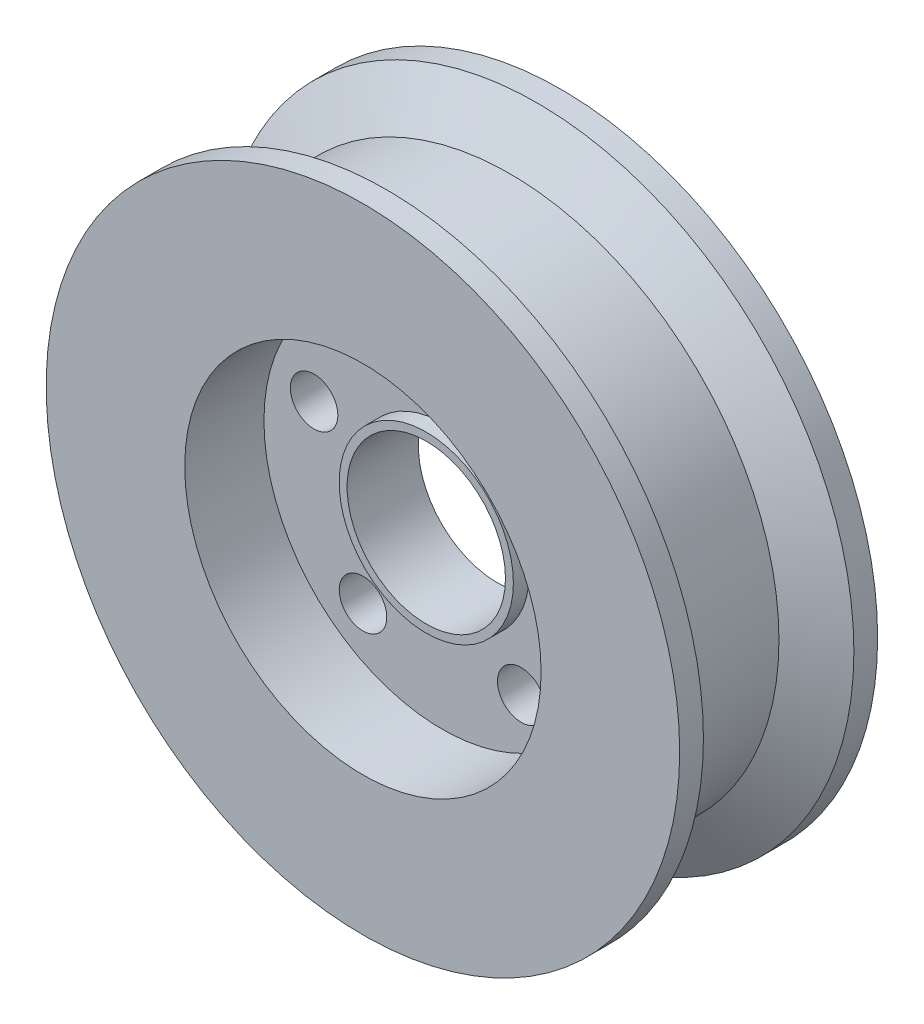
ISO-10303-21;
HEADER;
FILE_DESCRIPTION(('STEP AP214'),'2;1');
FILE_NAME('part.step','',(''),(''),'','','');
FILE_SCHEMA(('AUTOMOTIVE_DESIGN { 1 0 10303 214 1 1 1 1 }'));
ENDSEC;
DATA;
#1=APPLICATION_CONTEXT('core data for automotive mechanical design processes');
#2=APPLICATION_PROTOCOL_DEFINITION('international standard','automotive_design',2000,#1);
#3=PRODUCT_CONTEXT('',#1,'mechanical');
#4=PRODUCT('Part','Part','',(#3));
#5=PRODUCT_RELATED_PRODUCT_CATEGORY('part','',(#4));
#6=PRODUCT_DEFINITION_FORMATION('','',#4);
#7=PRODUCT_DEFINITION_CONTEXT('part definition',#1,'design');
#8=PRODUCT_DEFINITION('design','',#6,#7);
#9=PRODUCT_DEFINITION_SHAPE('','',#8);
#10=(LENGTH_UNIT() NAMED_UNIT(*) SI_UNIT(.MILLI.,.METRE.));
#11=(NAMED_UNIT(*) PLANE_ANGLE_UNIT() SI_UNIT($,.RADIAN.));
#12=(NAMED_UNIT(*) SI_UNIT($,.STERADIAN.) SOLID_ANGLE_UNIT());
#13=UNCERTAINTY_MEASURE_WITH_UNIT(LENGTH_MEASURE(1.E-05),#10,'distance_accuracy_value','');
#14=(GEOMETRIC_REPRESENTATION_CONTEXT(3) GLOBAL_UNCERTAINTY_ASSIGNED_CONTEXT((#13)) GLOBAL_UNIT_ASSIGNED_CONTEXT((#10,
#11,#12)) REPRESENTATION_CONTEXT('',''));
#15=CARTESIAN_POINT('',(0.,0.,0.));
#16=DIRECTION('',(0.,0.,1.));
#17=DIRECTION('',(1.,0.,0.));
#18=AXIS2_PLACEMENT_3D('',#15,#16,#17);
#19=CARTESIAN_POINT('',(0.,0.,12.5));
#20=DIRECTION('',(0.,0.,-1.));
#21=DIRECTION('',(-1.,0.,0.));
#22=AXIS2_PLACEMENT_3D('',#19,#20,#21);
#23=CYLINDRICAL_SURFACE('',#22,40.);
#24=CARTESIAN_POINT('',(0.,0.,-9.5));
#25=DIRECTION('',(0.,0.,1.));
#26=DIRECTION('',(1.,0.,0.));
#27=AXIS2_PLACEMENT_3D('',#24,#25,#26);
#28=CIRCLE('',#27,40.);
#29=CARTESIAN_POINT('',(40.,0.,-9.5));
#30=VERTEX_POINT('',#29);
#31=EDGE_CURVE('E56',#30,#30,#28,.T.);
#32=ORIENTED_EDGE('',*,*,#31,.F.);
#33=EDGE_LOOP('',(#32));
#34=FACE_BOUND('',#33,.T.);
#35=CARTESIAN_POINT('',(0.,0.,-12.5));
#36=DIRECTION('',(0.,0.,1.));
#37=DIRECTION('',(1.,0.,0.));
#38=AXIS2_PLACEMENT_3D('',#35,#36,#37);
#39=CIRCLE('',#38,40.);
#40=CARTESIAN_POINT('',(40.,0.,-12.5));
#41=VERTEX_POINT('',#40);
#42=EDGE_CURVE('E88',#41,#41,#39,.T.);
#43=ORIENTED_EDGE('',*,*,#42,.T.);
#44=EDGE_LOOP('',(#43));
#45=FACE_BOUND('',#44,.T.);
#46=ADVANCED_FACE('F30',(#34,#45),#23,.T.);
#47=CARTESIAN_POINT('',(0.,0.,12.5));
#48=DIRECTION('',(0.,0.,1.));
#49=DIRECTION('',(1.,0.,0.));
#50=AXIS2_PLACEMENT_3D('',#47,#48,#49);
#51=PLANE('',#50);
#52=CARTESIAN_POINT('',(0.,0.,12.5));
#53=DIRECTION('',(0.,0.,1.));
#54=DIRECTION('',(1.,0.,0.));
#55=AXIS2_PLACEMENT_3D('',#52,#53,#54);
#56=CIRCLE('',#55,22.5);
#57=CARTESIAN_POINT('',(22.5,0.,12.5));
#58=VERTEX_POINT('',#57);
#59=EDGE_CURVE('E81',#58,#58,#56,.T.);
#60=ORIENTED_EDGE('',*,*,#59,.F.);
#61=EDGE_LOOP('',(#60));
#62=FACE_BOUND('',#61,.T.);
#63=CARTESIAN_POINT('',(0.,0.,12.5));
#64=DIRECTION('',(0.,0.,1.));
#65=DIRECTION('',(1.,0.,0.));
#66=AXIS2_PLACEMENT_3D('',#63,#64,#65);
#67=CIRCLE('',#66,40.);
#68=CARTESIAN_POINT('',(40.,0.,12.5));
#69=VERTEX_POINT('',#68);
#70=EDGE_CURVE('E42',#69,#69,#67,.T.);
#71=ORIENTED_EDGE('',*,*,#70,.T.);
#72=EDGE_LOOP('',(#71));
#73=FACE_BOUND('',#72,.T.);
#74=ADVANCED_FACE('F135',(#62,#73),#51,.T.);
#75=CARTESIAN_POINT('',(0.,0.,-12.5));
#76=DIRECTION('',(0.,0.,1.));
#77=DIRECTION('',(1.,0.,0.));
#78=AXIS2_PLACEMENT_3D('',#75,#76,#77);
#79=PLANE('',#78);
#80=CARTESIAN_POINT('',(0.,0.,-12.5));
#81=DIRECTION('',(0.,0.,1.));
#82=DIRECTION('',(1.,0.,0.));
#83=AXIS2_PLACEMENT_3D('',#80,#81,#82);
#84=CIRCLE('',#83,22.5);
#85=CARTESIAN_POINT('',(22.5,0.,-12.5));
#86=VERTEX_POINT('',#85);
#87=EDGE_CURVE('E82',#86,#86,#84,.T.);
#88=ORIENTED_EDGE('',*,*,#87,.T.);
#89=EDGE_LOOP('',(#88));
#90=FACE_BOUND('',#89,.T.);
#91=ORIENTED_EDGE('',*,*,#42,.F.);
#92=EDGE_LOOP('',(#91));
#93=FACE_BOUND('',#92,.T.);
#94=ADVANCED_FACE('F132',(#90,#93),#79,.F.);
#95=CARTESIAN_POINT('',(0.,0.,9.5));
#96=DIRECTION('',(0.,0.,1.));
#97=DIRECTION('',(1.,0.,0.));
#98=AXIS2_PLACEMENT_3D('',#95,#96,#97);
#99=CIRCLE('',#98,40.);
#100=CARTESIAN_POINT('',(40.,0.,9.5));
#101=VERTEX_POINT('',#100);
#102=EDGE_CURVE('E53',#101,#101,#99,.T.);
#103=ORIENTED_EDGE('',*,*,#102,.T.);
#104=EDGE_LOOP('',(#103));
#105=FACE_BOUND('',#104,.T.);
#106=ORIENTED_EDGE('',*,*,#70,.F.);
#107=EDGE_LOOP('',(#106));
#108=FACE_BOUND('',#107,.T.);
#109=ADVANCED_FACE('F32',(#105,#108),#23,.T.);
#110=CARTESIAN_POINT('',(0.,0.,2.5));
#111=DIRECTION('',(0.,0.,1.));
#112=DIRECTION('',(1.,0.,0.));
#113=AXIS2_PLACEMENT_3D('',#110,#111,#112);
#114=CYLINDRICAL_SURFACE('',#113,22.5);
#115=CARTESIAN_POINT('',(0.,0.,2.5));
#116=DIRECTION('',(0.,0.,1.));
#117=DIRECTION('',(1.,0.,0.));
#118=AXIS2_PLACEMENT_3D('',#115,#116,#117);
#119=CIRCLE('',#118,22.5);
#120=CARTESIAN_POINT('',(22.5,0.,2.5));
#121=VERTEX_POINT('',#120);
#122=EDGE_CURVE('E85',#121,#121,#119,.T.);
#123=ORIENTED_EDGE('',*,*,#122,.F.);
#124=EDGE_LOOP('',(#123));
#125=FACE_BOUND('',#124,.T.);
#126=ORIENTED_EDGE('',*,*,#59,.T.);
#127=EDGE_LOOP('',(#126));
#128=FACE_BOUND('',#127,.T.);
#129=ADVANCED_FACE('F147',(#125,#128),#114,.F.);
#130=CARTESIAN_POINT('',(0.,0.,2.5));
#131=DIRECTION('',(0.,0.,1.));
#132=DIRECTION('',(1.,0.,0.));
#133=AXIS2_PLACEMENT_3D('',#130,#131,#132);
#134=PLANE('',#133);
#135=CARTESIAN_POINT('',(0.,0.,2.5));
#136=DIRECTION('',(0.,0.,1.));
#137=DIRECTION('',(1.,0.,0.));
#138=AXIS2_PLACEMENT_3D('',#135,#136,#137);
#139=CIRCLE('',#138,11.);
#140=CARTESIAN_POINT('',(11.,0.,2.5));
#141=VERTEX_POINT('',#140);
#142=EDGE_CURVE('E10',#141,#141,#139,.T.);
#143=ORIENTED_EDGE('',*,*,#142,.F.);
#144=EDGE_LOOP('',(#143));
#145=FACE_BOUND('',#144,.T.);
#146=CARTESIAN_POINT('',(9.99234928897197,-13.7532889043742,2.5));
#147=DIRECTION('',(0.,0.,1.));
#148=DIRECTION('',(-0.809016994374951,-0.587785252292469,0.));
#149=AXIS2_PLACEMENT_3D('',#146,#147,#148);
#150=CIRCLE('',#149,3.);
#151=CARTESIAN_POINT('',(7.56529830584712,-15.5166446612516,2.5));
#152=VERTEX_POINT('',#151);
#153=EDGE_CURVE('E60',#152,#152,#150,.T.);
#154=ORIENTED_EDGE('',*,*,#153,.F.);
#155=EDGE_LOOP('',(#154));
#156=FACE_BOUND('',#155,.T.);
#157=CARTESIAN_POINT('',(-9.99234928897216,-13.753288904374,2.5));
#158=DIRECTION('',(0.,0.,1.));
#159=DIRECTION('',(-0.809016994374942,0.58778525229248,0.));
#160=AXIS2_PLACEMENT_3D('',#157,#158,#159);
#161=CIRCLE('',#160,3.);
#162=CARTESIAN_POINT('',(-12.419400272097,-11.9899331474966,2.5));
#163=VERTEX_POINT('',#162);
#164=EDGE_CURVE('E64',#163,#163,#161,.T.);
#165=ORIENTED_EDGE('',*,*,#164,.F.);
#166=EDGE_LOOP('',(#165));
#167=FACE_BOUND('',#166,.T.);
#168=CARTESIAN_POINT('',(-16.1679607770176,5.25328890437429,2.5));
#169=DIRECTION('',(0.,0.,1.));
#170=DIRECTION('',(0.309016994374958,0.95105651629515,0.));
#171=AXIS2_PLACEMENT_3D('',#168,#169,#170);
#172=CIRCLE('',#171,3.);
#173=CARTESIAN_POINT('',(-15.2409097938927,8.10645845325974,2.5));
#174=VERTEX_POINT('',#173);
#175=EDGE_CURVE('E59',#174,#174,#172,.T.);
#176=ORIENTED_EDGE('',*,*,#175,.F.);
#177=EDGE_LOOP('',(#176));
#178=FACE_BOUND('',#177,.T.);
#179=CARTESIAN_POINT('',(16.1679607770176,5.25328890437406,2.5));
#180=DIRECTION('',(0.,0.,1.));
#181=DIRECTION('',(0.309016994374945,-0.951056516295155,0.));
#182=AXIS2_PLACEMENT_3D('',#179,#180,#181);
#183=CIRCLE('',#182,3.);
#184=CARTESIAN_POINT('',(17.0950117601425,2.4001193554886,2.5));
#185=VERTEX_POINT('',#184);
#186=EDGE_CURVE('E69',#185,#185,#183,.T.);
#187=ORIENTED_EDGE('',*,*,#186,.F.);
#188=EDGE_LOOP('',(#187));
#189=FACE_BOUND('',#188,.T.);
#190=CARTESIAN_POINT('',(0.,17.,2.5));
#191=DIRECTION('',(0.,0.,1.));
#192=DIRECTION('',(1.,0.,0.));
#193=AXIS2_PLACEMENT_3D('',#190,#191,#192);
#194=CIRCLE('',#193,3.);
#195=CARTESIAN_POINT('',(3.,17.,2.5));
#196=VERTEX_POINT('',#195);
#197=EDGE_CURVE('E74',#196,#196,#194,.T.);
#198=ORIENTED_EDGE('',*,*,#197,.F.);
#199=EDGE_LOOP('',(#198));
#200=FACE_BOUND('',#199,.T.);
#201=ORIENTED_EDGE('',*,*,#122,.T.);
#202=EDGE_LOOP('',(#201));
#203=FACE_BOUND('',#202,.T.);
#204=ADVANCED_FACE('F128',(#145,#156,#167,#178,#189,#200,#203),#134,.T.);
#205=CARTESIAN_POINT('',(0.,0.,-2.5));
#206=DIRECTION('',(0.,0.,-1.));
#207=DIRECTION('',(-1.,0.,0.));
#208=AXIS2_PLACEMENT_3D('',#205,#206,#207);
#209=CYLINDRICAL_SURFACE('',#208,22.5);
#210=CARTESIAN_POINT('',(0.,0.,-2.5));
#211=DIRECTION('',(0.,0.,1.));
#212=DIRECTION('',(1.,0.,0.));
#213=AXIS2_PLACEMENT_3D('',#210,#211,#212);
#214=CIRCLE('',#213,22.5);
#215=CARTESIAN_POINT('',(22.5,0.,-2.5));
#216=VERTEX_POINT('',#215);
#217=EDGE_CURVE('E78',#216,#216,#214,.T.);
#218=ORIENTED_EDGE('',*,*,#217,.T.);
#219=EDGE_LOOP('',(#218));
#220=FACE_BOUND('',#219,.T.);
#221=ORIENTED_EDGE('',*,*,#87,.F.);
#222=EDGE_LOOP('',(#221));
#223=FACE_BOUND('',#222,.T.);
#224=ADVANCED_FACE('F113',(#220,#223),#209,.F.);
#225=CARTESIAN_POINT('',(0.,0.,-2.5));
#226=DIRECTION('',(0.,0.,-1.));
#227=DIRECTION('',(1.,0.,0.));
#228=AXIS2_PLACEMENT_3D('',#225,#226,#227);
#229=PLANE('',#228);
#230=CARTESIAN_POINT('',(0.,0.,-2.5));
#231=DIRECTION('',(0.,0.,-1.));
#232=DIRECTION('',(-1.,0.,0.));
#233=AXIS2_PLACEMENT_3D('',#230,#231,#232);
#234=CIRCLE('',#233,11.);
#235=CARTESIAN_POINT('',(-11.,0.,-2.5));
#236=VERTEX_POINT('',#235);
#237=EDGE_CURVE('E34',#236,#236,#234,.T.);
#238=ORIENTED_EDGE('',*,*,#237,.F.);
#239=EDGE_LOOP('',(#238));
#240=FACE_BOUND('',#239,.T.);
#241=CARTESIAN_POINT('',(9.99234928897197,-13.7532889043742,-2.5));
#242=DIRECTION('',(0.,0.,-1.));
#243=DIRECTION('',(-1.,0.,0.));
#244=AXIS2_PLACEMENT_3D('',#241,#242,#243);
#245=CIRCLE('',#244,3.);
#246=CARTESIAN_POINT('',(6.99234928897197,-13.7532889043742,-2.5));
#247=VERTEX_POINT('',#246);
#248=EDGE_CURVE('E73',#247,#247,#245,.T.);
#249=ORIENTED_EDGE('',*,*,#248,.F.);
#250=EDGE_LOOP('',(#249));
#251=FACE_BOUND('',#250,.T.);
#252=CARTESIAN_POINT('',(-9.99234928897216,-13.753288904374,-2.5));
#253=DIRECTION('',(0.,0.,-1.));
#254=DIRECTION('',(-1.,0.,0.));
#255=AXIS2_PLACEMENT_3D('',#252,#253,#254);
#256=CIRCLE('',#255,3.);
#257=CARTESIAN_POINT('',(-12.9923492889722,-13.753288904374,-2.5));
#258=VERTEX_POINT('',#257);
#259=EDGE_CURVE('E101',#258,#258,#256,.T.);
#260=ORIENTED_EDGE('',*,*,#259,.F.);
#261=EDGE_LOOP('',(#260));
#262=FACE_BOUND('',#261,.T.);
#263=CARTESIAN_POINT('',(-16.1679607770176,5.25328890437429,-2.5));
#264=DIRECTION('',(0.,0.,-1.));
#265=DIRECTION('',(-1.,0.,0.));
#266=AXIS2_PLACEMENT_3D('',#263,#264,#265);
#267=CIRCLE('',#266,3.);
#268=CARTESIAN_POINT('',(-19.1679607770176,5.25328890437429,-2.5));
#269=VERTEX_POINT('',#268);
#270=EDGE_CURVE('E63',#269,#269,#267,.T.);
#271=ORIENTED_EDGE('',*,*,#270,.F.);
#272=EDGE_LOOP('',(#271));
#273=FACE_BOUND('',#272,.T.);
#274=CARTESIAN_POINT('',(16.1679607770176,5.25328890437406,-2.5));
#275=DIRECTION('',(0.,0.,-1.));
#276=DIRECTION('',(-1.,0.,0.));
#277=AXIS2_PLACEMENT_3D('',#274,#275,#276);
#278=CIRCLE('',#277,3.);
#279=CARTESIAN_POINT('',(13.1679607770176,5.25328890437406,-2.5));
#280=VERTEX_POINT('',#279);
#281=EDGE_CURVE('E72',#280,#280,#278,.T.);
#282=ORIENTED_EDGE('',*,*,#281,.F.);
#283=EDGE_LOOP('',(#282));
#284=FACE_BOUND('',#283,.T.);
#285=CARTESIAN_POINT('',(0.,17.,-2.5));
#286=DIRECTION('',(0.,0.,-1.));
#287=DIRECTION('',(-1.,0.,0.));
#288=AXIS2_PLACEMENT_3D('',#285,#286,#287);
#289=CIRCLE('',#288,3.);
#290=CARTESIAN_POINT('',(-3.,17.,-2.5));
#291=VERTEX_POINT('',#290);
#292=EDGE_CURVE('E77',#291,#291,#289,.T.);
#293=ORIENTED_EDGE('',*,*,#292,.F.);
#294=EDGE_LOOP('',(#293));
#295=FACE_BOUND('',#294,.T.);
#296=ORIENTED_EDGE('',*,*,#217,.F.);
#297=EDGE_LOOP('',(#296));
#298=FACE_BOUND('',#297,.T.);
#299=ADVANCED_FACE('F109',(#240,#251,#262,#273,#284,#295,#298),#229,.T.);
#300=CARTESIAN_POINT('',(0.,17.,-12.5));
#301=DIRECTION('',(0.,0.,1.));
#302=DIRECTION('',(1.,0.,0.));
#303=AXIS2_PLACEMENT_3D('',#300,#301,#302);
#304=CYLINDRICAL_SURFACE('',#303,3.);
#305=ORIENTED_EDGE('',*,*,#292,.T.);
#306=EDGE_LOOP('',(#305));
#307=FACE_BOUND('',#306,.T.);
#308=ORIENTED_EDGE('',*,*,#197,.T.);
#309=EDGE_LOOP('',(#308));
#310=FACE_BOUND('',#309,.T.);
#311=ADVANCED_FACE('F112',(#307,#310),#304,.F.);
#312=CARTESIAN_POINT('',(16.1679607770176,5.25328890437406,-12.5));
#313=DIRECTION('',(0.,0.,1.));
#314=DIRECTION('',(1.,0.,0.));
#315=AXIS2_PLACEMENT_3D('',#312,#313,#314);
#316=CYLINDRICAL_SURFACE('',#315,3.);
#317=ORIENTED_EDGE('',*,*,#281,.T.);
#318=EDGE_LOOP('',(#317));
#319=FACE_BOUND('',#318,.T.);
#320=ORIENTED_EDGE('',*,*,#186,.T.);
#321=EDGE_LOOP('',(#320));
#322=FACE_BOUND('',#321,.T.);
#323=ADVANCED_FACE('F188',(#319,#322),#316,.F.);
#324=CARTESIAN_POINT('',(-16.1679607770176,5.25328890437429,-12.5));
#325=DIRECTION('',(0.,0.,1.));
#326=DIRECTION('',(1.,0.,0.));
#327=AXIS2_PLACEMENT_3D('',#324,#325,#326);
#328=CYLINDRICAL_SURFACE('',#327,3.);
#329=ORIENTED_EDGE('',*,*,#270,.T.);
#330=EDGE_LOOP('',(#329));
#331=FACE_BOUND('',#330,.T.);
#332=ORIENTED_EDGE('',*,*,#175,.T.);
#333=EDGE_LOOP('',(#332));
#334=FACE_BOUND('',#333,.T.);
#335=ADVANCED_FACE('F184',(#331,#334),#328,.F.);
#336=CARTESIAN_POINT('',(-9.99234928897216,-13.753288904374,-12.5));
#337=DIRECTION('',(0.,0.,1.));
#338=DIRECTION('',(1.,0.,0.));
#339=AXIS2_PLACEMENT_3D('',#336,#337,#338);
#340=CYLINDRICAL_SURFACE('',#339,3.);
#341=ORIENTED_EDGE('',*,*,#259,.T.);
#342=EDGE_LOOP('',(#341));
#343=FACE_BOUND('',#342,.T.);
#344=ORIENTED_EDGE('',*,*,#164,.T.);
#345=EDGE_LOOP('',(#344));
#346=FACE_BOUND('',#345,.T.);
#347=ADVANCED_FACE('F179',(#343,#346),#340,.F.);
#348=CARTESIAN_POINT('',(9.99234928897197,-13.7532889043742,-12.5));
#349=DIRECTION('',(0.,0.,1.));
#350=DIRECTION('',(1.,0.,0.));
#351=AXIS2_PLACEMENT_3D('',#348,#349,#350);
#352=CYLINDRICAL_SURFACE('',#351,3.);
#353=ORIENTED_EDGE('',*,*,#248,.T.);
#354=EDGE_LOOP('',(#353));
#355=FACE_BOUND('',#354,.T.);
#356=ORIENTED_EDGE('',*,*,#153,.T.);
#357=EDGE_LOOP('',(#356));
#358=FACE_BOUND('',#357,.T.);
#359=ADVANCED_FACE('F106',(#355,#358),#352,.F.);
#360=CARTESIAN_POINT('',(0.,0.,-9.5));
#361=DIRECTION('',(0.,0.,-1.));
#362=DIRECTION('',(-1.,0.,0.));
#363=AXIS2_PLACEMENT_3D('',#360,#361,#362);
#364=CONICAL_SURFACE('',#363,40.,1.04719755119659);
#365=CARTESIAN_POINT('',(0.,0.,-6.03589838486221));
#366=DIRECTION('',(0.,0.,1.));
#367=DIRECTION('',(1.,0.,0.));
#368=AXIS2_PLACEMENT_3D('',#365,#366,#367);
#369=CIRCLE('',#368,34.);
#370=CARTESIAN_POINT('',(34.,0.,-6.03589838486221));
#371=VERTEX_POINT('',#370);
#372=EDGE_CURVE('E47',#371,#371,#369,.T.);
#373=ORIENTED_EDGE('',*,*,#372,.F.);
#374=EDGE_LOOP('',(#373));
#375=FACE_BOUND('',#374,.T.);
#376=ORIENTED_EDGE('',*,*,#31,.T.);
#377=EDGE_LOOP('',(#376));
#378=FACE_BOUND('',#377,.T.);
#379=ADVANCED_FACE('F163',(#375,#378),#364,.T.);
#380=CARTESIAN_POINT('',(0.,0.,6.03589838486221));
#381=DIRECTION('',(0.,0.,1.));
#382=DIRECTION('',(1.,0.,0.));
#383=AXIS2_PLACEMENT_3D('',#380,#381,#382);
#384=CONICAL_SURFACE('',#383,34.,1.04719755119659);
#385=ORIENTED_EDGE('',*,*,#102,.F.);
#386=EDGE_LOOP('',(#385));
#387=FACE_BOUND('',#386,.T.);
#388=CARTESIAN_POINT('',(0.,0.,6.03589838486221));
#389=DIRECTION('',(0.,0.,1.));
#390=DIRECTION('',(1.,0.,0.));
#391=AXIS2_PLACEMENT_3D('',#388,#389,#390);
#392=CIRCLE('',#391,34.);
#393=CARTESIAN_POINT('',(34.,0.,6.03589838486221));
#394=VERTEX_POINT('',#393);
#395=EDGE_CURVE('E50',#394,#394,#392,.T.);
#396=ORIENTED_EDGE('',*,*,#395,.T.);
#397=EDGE_LOOP('',(#396));
#398=FACE_BOUND('',#397,.T.);
#399=ADVANCED_FACE('F159',(#387,#398),#384,.T.);
#400=CARTESIAN_POINT('',(0.,0.,0.));
#401=DIRECTION('',(0.,0.,1.));
#402=DIRECTION('',(1.,0.,0.));
#403=AXIS2_PLACEMENT_3D('',#400,#401,#402);
#404=CYLINDRICAL_SURFACE('',#403,34.);
#405=ORIENTED_EDGE('',*,*,#395,.F.);
#406=EDGE_LOOP('',(#405));
#407=FACE_BOUND('',#406,.T.);
#408=ORIENTED_EDGE('',*,*,#372,.T.);
#409=EDGE_LOOP('',(#408));
#410=FACE_BOUND('',#409,.T.);
#411=ADVANCED_FACE('F162',(#407,#410),#404,.T.);
#412=CARTESIAN_POINT('',(0.,0.,-4.5));
#413=DIRECTION('',(0.,0.,1.));
#414=DIRECTION('',(1.,0.,0.));
#415=AXIS2_PLACEMENT_3D('',#412,#413,#414);
#416=CYLINDRICAL_SURFACE('',#415,11.);
#417=ORIENTED_EDGE('',*,*,#237,.T.);
#418=EDGE_LOOP('',(#417));
#419=FACE_BOUND('',#418,.T.);
#420=CARTESIAN_POINT('',(0.,0.,-4.5));
#421=DIRECTION('',(0.,0.,1.));
#422=DIRECTION('',(1.,0.,0.));
#423=AXIS2_PLACEMENT_3D('',#420,#421,#422);
#424=CIRCLE('',#423,11.);
#425=CARTESIAN_POINT('',(11.,0.,-4.5));
#426=VERTEX_POINT('',#425);
#427=EDGE_CURVE('E45',#426,#426,#424,.T.);
#428=ORIENTED_EDGE('',*,*,#427,.T.);
#429=EDGE_LOOP('',(#428));
#430=FACE_BOUND('',#429,.T.);
#431=ADVANCED_FACE('F169',(#419,#430),#416,.T.);
#432=CARTESIAN_POINT('',(0.,0.,-4.5));
#433=DIRECTION('',(0.,0.,1.));
#434=DIRECTION('',(1.,0.,0.));
#435=AXIS2_PLACEMENT_3D('',#432,#433,#434);
#436=PLANE('',#435);
#437=CARTESIAN_POINT('',(0.,0.,-4.5));
#438=DIRECTION('',(0.,0.,1.));
#439=DIRECTION('',(1.,0.,0.));
#440=AXIS2_PLACEMENT_3D('',#437,#438,#439);
#441=CIRCLE('',#440,10.);
#442=CARTESIAN_POINT('',(10.,0.,-4.5));
#443=VERTEX_POINT('',#442);
#444=EDGE_CURVE('E212',#443,#443,#441,.T.);
#445=ORIENTED_EDGE('',*,*,#444,.T.);
#446=EDGE_LOOP('',(#445));
#447=FACE_BOUND('',#446,.T.);
#448=ORIENTED_EDGE('',*,*,#427,.F.);
#449=EDGE_LOOP('',(#448));
#450=FACE_BOUND('',#449,.T.);
#451=ADVANCED_FACE('F226',(#447,#450),#436,.F.);
#452=ORIENTED_EDGE('',*,*,#142,.T.);
#453=EDGE_LOOP('',(#452));
#454=FACE_BOUND('',#453,.T.);
#455=CARTESIAN_POINT('',(0.,0.,4.5));
#456=DIRECTION('',(0.,0.,1.));
#457=DIRECTION('',(1.,0.,0.));
#458=AXIS2_PLACEMENT_3D('',#455,#456,#457);
#459=CIRCLE('',#458,11.);
#460=CARTESIAN_POINT('',(11.,0.,4.5));
#461=VERTEX_POINT('',#460);
#462=EDGE_CURVE('E217',#461,#461,#459,.T.);
#463=ORIENTED_EDGE('',*,*,#462,.F.);
#464=EDGE_LOOP('',(#463));
#465=FACE_BOUND('',#464,.T.);
#466=ADVANCED_FACE('F206',(#454,#465),#416,.T.);
#467=CARTESIAN_POINT('',(0.,0.,4.5));
#468=DIRECTION('',(0.,0.,1.));
#469=DIRECTION('',(1.,0.,0.));
#470=AXIS2_PLACEMENT_3D('',#467,#468,#469);
#471=PLANE('',#470);
#472=ORIENTED_EDGE('',*,*,#462,.T.);
#473=EDGE_LOOP('',(#472));
#474=FACE_BOUND('',#473,.T.);
#475=CARTESIAN_POINT('',(0.,0.,4.5));
#476=DIRECTION('',(0.,0.,1.));
#477=DIRECTION('',(1.,0.,0.));
#478=AXIS2_PLACEMENT_3D('',#475,#476,#477);
#479=CIRCLE('',#478,10.);
#480=CARTESIAN_POINT('',(10.,0.,4.5));
#481=VERTEX_POINT('',#480);
#482=EDGE_CURVE('E215',#481,#481,#479,.T.);
#483=ORIENTED_EDGE('',*,*,#482,.F.);
#484=EDGE_LOOP('',(#483));
#485=FACE_BOUND('',#484,.T.);
#486=ADVANCED_FACE('F201',(#474,#485),#471,.T.);
#487=CARTESIAN_POINT('',(0.,0.,12.5));
#488=DIRECTION('',(0.,0.,-1.));
#489=DIRECTION('',(-1.,0.,0.));
#490=AXIS2_PLACEMENT_3D('',#487,#488,#489);
#491=CYLINDRICAL_SURFACE('',#490,10.);
#492=ORIENTED_EDGE('',*,*,#444,.F.);
#493=EDGE_LOOP('',(#492));
#494=FACE_BOUND('',#493,.T.);
#495=ORIENTED_EDGE('',*,*,#482,.T.);
#496=EDGE_LOOP('',(#495));
#497=FACE_BOUND('',#496,.T.);
#498=ADVANCED_FACE('F199',(#494,#497),#491,.F.);
#499=CLOSED_SHELL('',(#46,#74,#94,#109,#129,#204,#224,#299,#311,#323,#335,#347,#359,#379,#399,
#411,#431,#451,#466,#486,#498));
#500=MANIFOLD_SOLID_BREP('B2',#499);
#501=ADVANCED_BREP_SHAPE_REPRESENTATION('',(#18,#500),#14);
#502=SHAPE_DEFINITION_REPRESENTATION(#9,#501);
ENDSEC;
END-ISO-10303-21;
